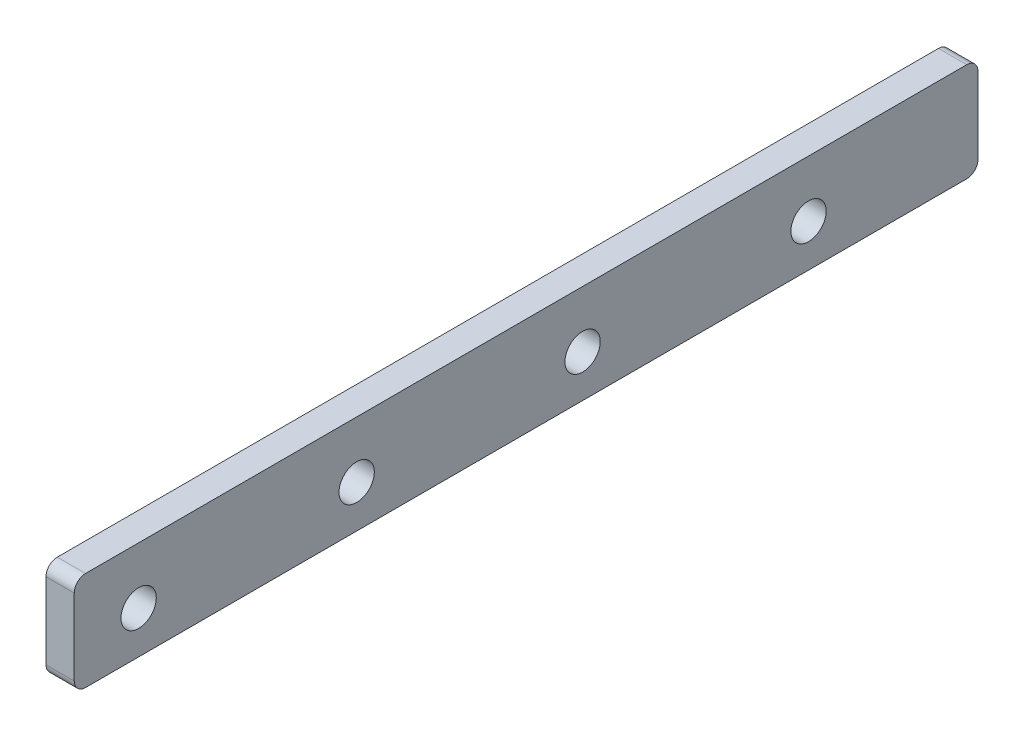
ISO-10303-21;
HEADER;
FILE_DESCRIPTION(('STEP AP214'),'2;1');
FILE_NAME('part.step','',(''),(''),'','','');
FILE_SCHEMA(('AUTOMOTIVE_DESIGN { 1 0 10303 214 1 1 1 1 }'));
ENDSEC;
DATA;
#1=APPLICATION_CONTEXT('core data for automotive mechanical design processes');
#2=APPLICATION_PROTOCOL_DEFINITION('international standard','automotive_design',2000,#1);
#3=PRODUCT_CONTEXT('',#1,'mechanical');
#4=PRODUCT('Part','Part','',(#3));
#5=PRODUCT_RELATED_PRODUCT_CATEGORY('part','',(#4));
#6=PRODUCT_DEFINITION_FORMATION('','',#4);
#7=PRODUCT_DEFINITION_CONTEXT('part definition',#1,'design');
#8=PRODUCT_DEFINITION('design','',#6,#7);
#9=PRODUCT_DEFINITION_SHAPE('','',#8);
#10=(LENGTH_UNIT() NAMED_UNIT(*) SI_UNIT(.MILLI.,.METRE.));
#11=(NAMED_UNIT(*) PLANE_ANGLE_UNIT() SI_UNIT($,.RADIAN.));
#12=(NAMED_UNIT(*) SI_UNIT($,.STERADIAN.) SOLID_ANGLE_UNIT());
#13=UNCERTAINTY_MEASURE_WITH_UNIT(LENGTH_MEASURE(1.E-05),#10,'distance_accuracy_value','');
#14=(GEOMETRIC_REPRESENTATION_CONTEXT(3) GLOBAL_UNCERTAINTY_ASSIGNED_CONTEXT((#13)) GLOBAL_UNIT_ASSIGNED_CONTEXT((#10,
#11,#12)) REPRESENTATION_CONTEXT('',''));
#15=CARTESIAN_POINT('',(0.,0.,0.));
#16=DIRECTION('',(0.,0.,1.));
#17=DIRECTION('',(1.,0.,0.));
#18=AXIS2_PLACEMENT_3D('',#15,#16,#17);
#19=CARTESIAN_POINT('',(6.35,0.,47.625));
#20=DIRECTION('',(0.,0.,-1.));
#21=DIRECTION('',(-1.,0.,0.));
#22=AXIS2_PLACEMENT_3D('',#19,#20,#21);
#23=PLANE('',#22);
#24=DIRECTION('',(0.,-1.,0.));
#25=VECTOR('',#24,1.);
#26=CARTESIAN_POINT('',(0.,0.,47.625));
#27=LINE('',#26,#25);
#28=CARTESIAN_POINT('',(0.,22.86,47.625));
#29=VERTEX_POINT('',#28);
#30=CARTESIAN_POINT('',(0.,5.715,47.625));
#31=VERTEX_POINT('',#30);
#32=EDGE_CURVE('E131',#29,#31,#27,.T.);
#33=ORIENTED_EDGE('',*,*,#32,.T.);
#34=DIRECTION('',(-1.,0.,0.));
#35=VECTOR('',#34,1.);
#36=CARTESIAN_POINT('',(6.35,5.715,47.625));
#37=LINE('',#36,#35);
#38=CARTESIAN_POINT('',(6.35,5.715,47.625));
#39=VERTEX_POINT('',#38);
#40=EDGE_CURVE('E108',#31,#39,#37,.F.);
#41=ORIENTED_EDGE('',*,*,#40,.T.);
#42=DIRECTION('',(0.,-1.,0.));
#43=VECTOR('',#42,1.);
#44=CARTESIAN_POINT('',(6.35,0.,47.625));
#45=LINE('',#44,#43);
#46=CARTESIAN_POINT('',(6.35,22.86,47.625));
#47=VERTEX_POINT('',#46);
#48=EDGE_CURVE('E184',#47,#39,#45,.T.);
#49=ORIENTED_EDGE('',*,*,#48,.F.);
#50=DIRECTION('',(-1.,0.,0.));
#51=VECTOR('',#50,1.);
#52=CARTESIAN_POINT('',(6.35,22.86,47.625));
#53=LINE('',#52,#51);
#54=EDGE_CURVE('E113',#47,#29,#53,.T.);
#55=ORIENTED_EDGE('',*,*,#54,.T.);
#56=EDGE_LOOP('',(#33,#41,#49,#55));
#57=FACE_BOUND('',#56,.T.);
#58=ADVANCED_FACE('F38',(#57),#23,.F.);
#59=CARTESIAN_POINT('',(6.35,3.175,0.));
#60=DIRECTION('',(0.,1.,0.));
#61=DIRECTION('',(0.,0.,1.));
#62=AXIS2_PLACEMENT_3D('',#59,#60,#61);
#63=PLANE('',#62);
#64=DIRECTION('',(0.,0.,-1.));
#65=VECTOR('',#64,1.);
#66=CARTESIAN_POINT('',(6.35,3.175,0.));
#67=LINE('',#66,#65);
#68=CARTESIAN_POINT('',(6.35,3.175,45.085));
#69=VERTEX_POINT('',#68);
#70=CARTESIAN_POINT('',(6.35,3.175,-153.035));
#71=VERTEX_POINT('',#70);
#72=EDGE_CURVE('E123',#69,#71,#67,.T.);
#73=ORIENTED_EDGE('',*,*,#72,.F.);
#74=DIRECTION('',(-1.,0.,0.));
#75=VECTOR('',#74,1.);
#76=CARTESIAN_POINT('',(6.35,3.175,45.085));
#77=LINE('',#76,#75);
#78=CARTESIAN_POINT('',(0.,3.175,45.085));
#79=VERTEX_POINT('',#78);
#80=EDGE_CURVE('E107',#69,#79,#77,.T.);
#81=ORIENTED_EDGE('',*,*,#80,.T.);
#82=DIRECTION('',(0.,0.,-1.));
#83=VECTOR('',#82,1.);
#84=CARTESIAN_POINT('',(0.,3.175,0.));
#85=LINE('',#84,#83);
#86=CARTESIAN_POINT('',(0.,3.175,-153.035));
#87=VERTEX_POINT('',#86);
#88=EDGE_CURVE('E120',#79,#87,#85,.T.);
#89=ORIENTED_EDGE('',*,*,#88,.T.);
#90=DIRECTION('',(-1.,0.,0.));
#91=VECTOR('',#90,1.);
#92=CARTESIAN_POINT('',(6.35,3.175,-153.035));
#93=LINE('',#92,#91);
#94=EDGE_CURVE('E125',#87,#71,#93,.F.);
#95=ORIENTED_EDGE('',*,*,#94,.T.);
#96=EDGE_LOOP('',(#73,#81,#89,#95));
#97=FACE_BOUND('',#96,.T.);
#98=ADVANCED_FACE('F119',(#97),#63,.F.);
#99=CARTESIAN_POINT('',(6.35,0.,-155.575));
#100=DIRECTION('',(0.,0.,1.));
#101=DIRECTION('',(1.,0.,0.));
#102=AXIS2_PLACEMENT_3D('',#99,#100,#101);
#103=PLANE('',#102);
#104=DIRECTION('',(0.,1.,0.));
#105=VECTOR('',#104,1.);
#106=CARTESIAN_POINT('',(6.35,0.,-155.575));
#107=LINE('',#106,#105);
#108=CARTESIAN_POINT('',(6.35,5.715,-155.575));
#109=VERTEX_POINT('',#108);
#110=CARTESIAN_POINT('',(6.35,22.86,-155.575));
#111=VERTEX_POINT('',#110);
#112=EDGE_CURVE('E186',#109,#111,#107,.T.);
#113=ORIENTED_EDGE('',*,*,#112,.F.);
#114=DIRECTION('',(-1.,0.,0.));
#115=VECTOR('',#114,1.);
#116=CARTESIAN_POINT('',(6.35,5.715,-155.575));
#117=LINE('',#116,#115);
#118=CARTESIAN_POINT('',(0.,5.715,-155.575));
#119=VERTEX_POINT('',#118);
#120=EDGE_CURVE('E169',#109,#119,#117,.T.);
#121=ORIENTED_EDGE('',*,*,#120,.T.);
#122=DIRECTION('',(0.,1.,0.));
#123=VECTOR('',#122,1.);
#124=CARTESIAN_POINT('',(0.,0.,-155.575));
#125=LINE('',#124,#123);
#126=CARTESIAN_POINT('',(0.,22.86,-155.575));
#127=VERTEX_POINT('',#126);
#128=EDGE_CURVE('E130',#119,#127,#125,.T.);
#129=ORIENTED_EDGE('',*,*,#128,.T.);
#130=DIRECTION('',(-1.,0.,0.));
#131=VECTOR('',#130,1.);
#132=CARTESIAN_POINT('',(6.35,22.86,-155.575));
#133=LINE('',#132,#131);
#134=EDGE_CURVE('E167',#127,#111,#133,.F.);
#135=ORIENTED_EDGE('',*,*,#134,.T.);
#136=EDGE_LOOP('',(#113,#121,#129,#135));
#137=FACE_BOUND('',#136,.T.);
#138=ADVANCED_FACE('F224',(#137),#103,.F.);
#139=CARTESIAN_POINT('',(6.35,12.7,-66.675));
#140=DIRECTION('',(-1.,0.,0.));
#141=DIRECTION('',(0.,0.,1.));
#142=AXIS2_PLACEMENT_3D('',#139,#140,#141);
#143=CYLINDRICAL_SURFACE('',#142,3.96874999999999);
#144=CARTESIAN_POINT('',(6.35,12.7,-66.675));
#145=DIRECTION('',(1.,0.,0.));
#146=DIRECTION('',(0.,0.,-1.));
#147=AXIS2_PLACEMENT_3D('',#144,#145,#146);
#148=CIRCLE('',#147,3.96874999999999);
#149=CARTESIAN_POINT('',(6.35,12.7,-70.64375));
#150=VERTEX_POINT('',#149);
#151=EDGE_CURVE('E196',#150,#150,#148,.T.);
#152=ORIENTED_EDGE('',*,*,#151,.T.);
#153=EDGE_LOOP('',(#152));
#154=FACE_BOUND('',#153,.T.);
#155=CARTESIAN_POINT('',(0.,12.7,-66.675));
#156=DIRECTION('',(1.,0.,0.));
#157=DIRECTION('',(0.,0.,-1.));
#158=AXIS2_PLACEMENT_3D('',#155,#156,#157);
#159=CIRCLE('',#158,3.96874999999999);
#160=CARTESIAN_POINT('',(0.,12.7,-70.64375));
#161=VERTEX_POINT('',#160);
#162=EDGE_CURVE('E144',#161,#161,#159,.T.);
#163=ORIENTED_EDGE('',*,*,#162,.F.);
#164=EDGE_LOOP('',(#163));
#165=FACE_BOUND('',#164,.T.);
#166=ADVANCED_FACE('F228',(#154,#165),#143,.F.);
#167=CARTESIAN_POINT('',(6.35,12.7,-117.475));
#168=DIRECTION('',(-1.,0.,0.));
#169=DIRECTION('',(0.,0.,1.));
#170=AXIS2_PLACEMENT_3D('',#167,#168,#169);
#171=CYLINDRICAL_SURFACE('',#170,3.96875);
#172=CARTESIAN_POINT('',(6.35,12.7,-117.475));
#173=DIRECTION('',(1.,0.,0.));
#174=DIRECTION('',(0.,0.,-1.));
#175=AXIS2_PLACEMENT_3D('',#172,#173,#174);
#176=CIRCLE('',#175,3.96875);
#177=CARTESIAN_POINT('',(6.35,12.7,-121.44375));
#178=VERTEX_POINT('',#177);
#179=EDGE_CURVE('E193',#178,#178,#176,.T.);
#180=ORIENTED_EDGE('',*,*,#179,.T.);
#181=EDGE_LOOP('',(#180));
#182=FACE_BOUND('',#181,.T.);
#183=CARTESIAN_POINT('',(0.,12.7,-117.475));
#184=DIRECTION('',(1.,0.,0.));
#185=DIRECTION('',(0.,0.,-1.));
#186=AXIS2_PLACEMENT_3D('',#183,#184,#185);
#187=CIRCLE('',#186,3.96875);
#188=CARTESIAN_POINT('',(0.,12.7,-121.44375));
#189=VERTEX_POINT('',#188);
#190=EDGE_CURVE('E141',#189,#189,#187,.T.);
#191=ORIENTED_EDGE('',*,*,#190,.F.);
#192=EDGE_LOOP('',(#191));
#193=FACE_BOUND('',#192,.T.);
#194=ADVANCED_FACE('F216',(#182,#193),#171,.F.);
#195=CARTESIAN_POINT('',(6.35,25.4,0.));
#196=DIRECTION('',(0.,-1.,0.));
#197=DIRECTION('',(0.,0.,-1.));
#198=AXIS2_PLACEMENT_3D('',#195,#196,#197);
#199=PLANE('',#198);
#200=DIRECTION('',(0.,0.,1.));
#201=VECTOR('',#200,1.);
#202=CARTESIAN_POINT('',(0.,25.4,0.));
#203=LINE('',#202,#201);
#204=CARTESIAN_POINT('',(0.,25.4,-153.035));
#205=VERTEX_POINT('',#204);
#206=CARTESIAN_POINT('',(0.,25.4,45.085));
#207=VERTEX_POINT('',#206);
#208=EDGE_CURVE('E134',#205,#207,#203,.T.);
#209=ORIENTED_EDGE('',*,*,#208,.T.);
#210=DIRECTION('',(-1.,0.,0.));
#211=VECTOR('',#210,1.);
#212=CARTESIAN_POINT('',(6.35,25.4,45.085));
#213=LINE('',#212,#211);
#214=CARTESIAN_POINT('',(6.35,25.4,45.085));
#215=VERTEX_POINT('',#214);
#216=EDGE_CURVE('E11',#207,#215,#213,.F.);
#217=ORIENTED_EDGE('',*,*,#216,.T.);
#218=DIRECTION('',(0.,0.,1.));
#219=VECTOR('',#218,1.);
#220=CARTESIAN_POINT('',(6.35,25.4,0.));
#221=LINE('',#220,#219);
#222=CARTESIAN_POINT('',(6.35,25.4,-153.035));
#223=VERTEX_POINT('',#222);
#224=EDGE_CURVE('E175',#223,#215,#221,.T.);
#225=ORIENTED_EDGE('',*,*,#224,.F.);
#226=DIRECTION('',(-1.,0.,0.));
#227=VECTOR('',#226,1.);
#228=CARTESIAN_POINT('',(6.35,25.4,-153.035));
#229=LINE('',#228,#227);
#230=EDGE_CURVE('E46',#223,#205,#229,.T.);
#231=ORIENTED_EDGE('',*,*,#230,.T.);
#232=EDGE_LOOP('',(#209,#217,#225,#231));
#233=FACE_BOUND('',#232,.T.);
#234=ADVANCED_FACE('F174',(#233),#199,.F.);
#235=CARTESIAN_POINT('',(6.35,12.7,33.147));
#236=DIRECTION('',(-1.,0.,0.));
#237=DIRECTION('',(0.,0.,1.));
#238=AXIS2_PLACEMENT_3D('',#235,#236,#237);
#239=CYLINDRICAL_SURFACE('',#238,3.96875);
#240=CARTESIAN_POINT('',(6.35,12.7,33.147));
#241=DIRECTION('',(1.,0.,0.));
#242=DIRECTION('',(0.,0.,-1.));
#243=AXIS2_PLACEMENT_3D('',#240,#241,#242);
#244=CIRCLE('',#243,3.96875);
#245=CARTESIAN_POINT('',(6.35,12.7,29.17825));
#246=VERTEX_POINT('',#245);
#247=EDGE_CURVE('E150',#246,#246,#244,.T.);
#248=ORIENTED_EDGE('',*,*,#247,.T.);
#249=EDGE_LOOP('',(#248));
#250=FACE_BOUND('',#249,.T.);
#251=CARTESIAN_POINT('',(0.,12.7,33.147));
#252=DIRECTION('',(1.,0.,0.));
#253=DIRECTION('',(0.,0.,-1.));
#254=AXIS2_PLACEMENT_3D('',#251,#252,#253);
#255=CIRCLE('',#254,3.96875);
#256=CARTESIAN_POINT('',(0.,12.7,29.17825));
#257=VERTEX_POINT('',#256);
#258=EDGE_CURVE('E136',#257,#257,#255,.T.);
#259=ORIENTED_EDGE('',*,*,#258,.F.);
#260=EDGE_LOOP('',(#259));
#261=FACE_BOUND('',#260,.T.);
#262=ADVANCED_FACE('F204',(#250,#261),#239,.F.);
#263=CARTESIAN_POINT('',(6.35,12.7,-15.875));
#264=DIRECTION('',(-1.,0.,0.));
#265=DIRECTION('',(0.,0.,1.));
#266=AXIS2_PLACEMENT_3D('',#263,#264,#265);
#267=CYLINDRICAL_SURFACE('',#266,3.96875);
#268=CARTESIAN_POINT('',(6.35,12.7,-15.875));
#269=DIRECTION('',(1.,0.,0.));
#270=DIRECTION('',(0.,0.,-1.));
#271=AXIS2_PLACEMENT_3D('',#268,#269,#270);
#272=CIRCLE('',#271,3.96875);
#273=CARTESIAN_POINT('',(6.35,12.7,-19.84375));
#274=VERTEX_POINT('',#273);
#275=EDGE_CURVE('E151',#274,#274,#272,.T.);
#276=ORIENTED_EDGE('',*,*,#275,.T.);
#277=EDGE_LOOP('',(#276));
#278=FACE_BOUND('',#277,.T.);
#279=CARTESIAN_POINT('',(0.,12.7,-15.875));
#280=DIRECTION('',(1.,0.,0.));
#281=DIRECTION('',(0.,0.,-1.));
#282=AXIS2_PLACEMENT_3D('',#279,#280,#281);
#283=CIRCLE('',#282,3.96875);
#284=CARTESIAN_POINT('',(0.,12.7,-19.84375));
#285=VERTEX_POINT('',#284);
#286=EDGE_CURVE('E147',#285,#285,#283,.T.);
#287=ORIENTED_EDGE('',*,*,#286,.F.);
#288=EDGE_LOOP('',(#287));
#289=FACE_BOUND('',#288,.T.);
#290=ADVANCED_FACE('F206',(#278,#289),#267,.F.);
#291=CARTESIAN_POINT('',(6.35,0.,0.));
#292=DIRECTION('',(1.,0.,0.));
#293=DIRECTION('',(0.,0.,-1.));
#294=AXIS2_PLACEMENT_3D('',#291,#292,#293);
#295=PLANE('',#294);
#296=ORIENTED_EDGE('',*,*,#247,.F.);
#297=EDGE_LOOP('',(#296));
#298=FACE_BOUND('',#297,.T.);
#299=ORIENTED_EDGE('',*,*,#48,.T.);
#300=CARTESIAN_POINT('',(6.35,5.715,45.085));
#301=DIRECTION('',(1.,0.,0.));
#302=DIRECTION('',(0.,0.,-1.));
#303=AXIS2_PLACEMENT_3D('',#300,#301,#302);
#304=CIRCLE('',#303,2.54);
#305=EDGE_CURVE('E165',#39,#69,#304,.T.);
#306=ORIENTED_EDGE('',*,*,#305,.T.);
#307=ORIENTED_EDGE('',*,*,#72,.T.);
#308=CARTESIAN_POINT('',(6.35,5.715,-153.035));
#309=DIRECTION('',(1.,0.,0.));
#310=DIRECTION('',(0.,0.,-1.));
#311=AXIS2_PLACEMENT_3D('',#308,#309,#310);
#312=CIRCLE('',#311,2.54);
#313=EDGE_CURVE('E163',#71,#109,#312,.T.);
#314=ORIENTED_EDGE('',*,*,#313,.T.);
#315=ORIENTED_EDGE('',*,*,#112,.T.);
#316=CARTESIAN_POINT('',(6.35,22.86,-153.035));
#317=DIRECTION('',(1.,0.,0.));
#318=DIRECTION('',(0.,0.,-1.));
#319=AXIS2_PLACEMENT_3D('',#316,#317,#318);
#320=CIRCLE('',#319,2.54);
#321=EDGE_CURVE('E58',#111,#223,#320,.T.);
#322=ORIENTED_EDGE('',*,*,#321,.T.);
#323=ORIENTED_EDGE('',*,*,#224,.T.);
#324=CARTESIAN_POINT('',(6.35,22.86,45.085));
#325=DIRECTION('',(1.,0.,0.));
#326=DIRECTION('',(0.,0.,-1.));
#327=AXIS2_PLACEMENT_3D('',#324,#325,#326);
#328=CIRCLE('',#327,2.54);
#329=EDGE_CURVE('E161',#215,#47,#328,.T.);
#330=ORIENTED_EDGE('',*,*,#329,.T.);
#331=EDGE_LOOP('',(#299,#306,#307,#314,#315,#322,#323,#330));
#332=FACE_BOUND('',#331,.T.);
#333=ORIENTED_EDGE('',*,*,#179,.F.);
#334=EDGE_LOOP('',(#333));
#335=FACE_BOUND('',#334,.T.);
#336=ORIENTED_EDGE('',*,*,#151,.F.);
#337=EDGE_LOOP('',(#336));
#338=FACE_BOUND('',#337,.T.);
#339=ORIENTED_EDGE('',*,*,#275,.F.);
#340=EDGE_LOOP('',(#339));
#341=FACE_BOUND('',#340,.T.);
#342=ADVANCED_FACE('F213',(#298,#332,#335,#338,#341),#295,.T.);
#343=CARTESIAN_POINT('',(0.,0.,0.));
#344=DIRECTION('',(1.,0.,0.));
#345=DIRECTION('',(0.,0.,-1.));
#346=AXIS2_PLACEMENT_3D('',#343,#344,#345);
#347=PLANE('',#346);
#348=ORIENTED_EDGE('',*,*,#258,.T.);
#349=EDGE_LOOP('',(#348));
#350=FACE_BOUND('',#349,.T.);
#351=ORIENTED_EDGE('',*,*,#88,.F.);
#352=CARTESIAN_POINT('',(0.,5.715,45.085));
#353=DIRECTION('',(1.,0.,0.));
#354=DIRECTION('',(0.,0.,-1.));
#355=AXIS2_PLACEMENT_3D('',#352,#353,#354);
#356=CIRCLE('',#355,2.54);
#357=EDGE_CURVE('E103',#79,#31,#356,.F.);
#358=ORIENTED_EDGE('',*,*,#357,.T.);
#359=ORIENTED_EDGE('',*,*,#32,.F.);
#360=CARTESIAN_POINT('',(0.,22.86,45.085));
#361=DIRECTION('',(1.,0.,0.));
#362=DIRECTION('',(0.,0.,-1.));
#363=AXIS2_PLACEMENT_3D('',#360,#361,#362);
#364=CIRCLE('',#363,2.54);
#365=EDGE_CURVE('E154',#29,#207,#364,.F.);
#366=ORIENTED_EDGE('',*,*,#365,.T.);
#367=ORIENTED_EDGE('',*,*,#208,.F.);
#368=CARTESIAN_POINT('',(0.,22.86,-153.035));
#369=DIRECTION('',(1.,0.,0.));
#370=DIRECTION('',(0.,0.,-1.));
#371=AXIS2_PLACEMENT_3D('',#368,#369,#370);
#372=CIRCLE('',#371,2.54);
#373=EDGE_CURVE('E124',#205,#127,#372,.F.);
#374=ORIENTED_EDGE('',*,*,#373,.T.);
#375=ORIENTED_EDGE('',*,*,#128,.F.);
#376=CARTESIAN_POINT('',(0.,5.715,-153.035));
#377=DIRECTION('',(1.,0.,0.));
#378=DIRECTION('',(0.,0.,-1.));
#379=AXIS2_PLACEMENT_3D('',#376,#377,#378);
#380=CIRCLE('',#379,2.54);
#381=EDGE_CURVE('E114',#119,#87,#380,.F.);
#382=ORIENTED_EDGE('',*,*,#381,.T.);
#383=EDGE_LOOP('',(#351,#358,#359,#366,#367,#374,#375,#382));
#384=FACE_BOUND('',#383,.T.);
#385=ORIENTED_EDGE('',*,*,#190,.T.);
#386=EDGE_LOOP('',(#385));
#387=FACE_BOUND('',#386,.T.);
#388=ORIENTED_EDGE('',*,*,#162,.T.);
#389=EDGE_LOOP('',(#388));
#390=FACE_BOUND('',#389,.T.);
#391=ORIENTED_EDGE('',*,*,#286,.T.);
#392=EDGE_LOOP('',(#391));
#393=FACE_BOUND('',#392,.T.);
#394=ADVANCED_FACE('F127',(#350,#384,#387,#390,#393),#347,.F.);
#395=CARTESIAN_POINT('',(6.35,5.715,45.085));
#396=DIRECTION('',(-1.,0.,0.));
#397=DIRECTION('',(0.,0.,1.));
#398=AXIS2_PLACEMENT_3D('',#395,#396,#397);
#399=CYLINDRICAL_SURFACE('',#398,2.54);
#400=ORIENTED_EDGE('',*,*,#305,.F.);
#401=ORIENTED_EDGE('',*,*,#40,.F.);
#402=ORIENTED_EDGE('',*,*,#357,.F.);
#403=ORIENTED_EDGE('',*,*,#80,.F.);
#404=EDGE_LOOP('',(#400,#401,#402,#403));
#405=FACE_BOUND('',#404,.T.);
#406=ADVANCED_FACE('F106',(#405),#399,.T.);
#407=CARTESIAN_POINT('',(6.35,5.715,-153.035));
#408=DIRECTION('',(-1.,0.,0.));
#409=DIRECTION('',(0.,0.,1.));
#410=AXIS2_PLACEMENT_3D('',#407,#408,#409);
#411=CYLINDRICAL_SURFACE('',#410,2.54);
#412=ORIENTED_EDGE('',*,*,#313,.F.);
#413=ORIENTED_EDGE('',*,*,#94,.F.);
#414=ORIENTED_EDGE('',*,*,#381,.F.);
#415=ORIENTED_EDGE('',*,*,#120,.F.);
#416=EDGE_LOOP('',(#412,#413,#414,#415));
#417=FACE_BOUND('',#416,.T.);
#418=ADVANCED_FACE('F271',(#417),#411,.T.);
#419=CARTESIAN_POINT('',(6.35,22.86,45.085));
#420=DIRECTION('',(-1.,0.,0.));
#421=DIRECTION('',(0.,0.,1.));
#422=AXIS2_PLACEMENT_3D('',#419,#420,#421);
#423=CYLINDRICAL_SURFACE('',#422,2.54);
#424=ORIENTED_EDGE('',*,*,#329,.F.);
#425=ORIENTED_EDGE('',*,*,#216,.F.);
#426=ORIENTED_EDGE('',*,*,#365,.F.);
#427=ORIENTED_EDGE('',*,*,#54,.F.);
#428=EDGE_LOOP('',(#424,#425,#426,#427));
#429=FACE_BOUND('',#428,.T.);
#430=ADVANCED_FACE('F180',(#429),#423,.T.);
#431=CARTESIAN_POINT('',(6.35,22.86,-153.035));
#432=DIRECTION('',(-1.,0.,0.));
#433=DIRECTION('',(0.,0.,1.));
#434=AXIS2_PLACEMENT_3D('',#431,#432,#433);
#435=CYLINDRICAL_SURFACE('',#434,2.54);
#436=ORIENTED_EDGE('',*,*,#321,.F.);
#437=ORIENTED_EDGE('',*,*,#134,.F.);
#438=ORIENTED_EDGE('',*,*,#373,.F.);
#439=ORIENTED_EDGE('',*,*,#230,.F.);
#440=EDGE_LOOP('',(#436,#437,#438,#439));
#441=FACE_BOUND('',#440,.T.);
#442=ADVANCED_FACE('F40',(#441),#435,.T.);
#443=CLOSED_SHELL('',(#58,#98,#138,#166,#194,#234,#262,#290,#342,#394,#406,#418,#430,#442));
#444=MANIFOLD_SOLID_BREP('B2',#443);
#445=ADVANCED_BREP_SHAPE_REPRESENTATION('',(#18,#444),#14);
#446=SHAPE_DEFINITION_REPRESENTATION(#9,#445);
ENDSEC;
END-ISO-10303-21;
